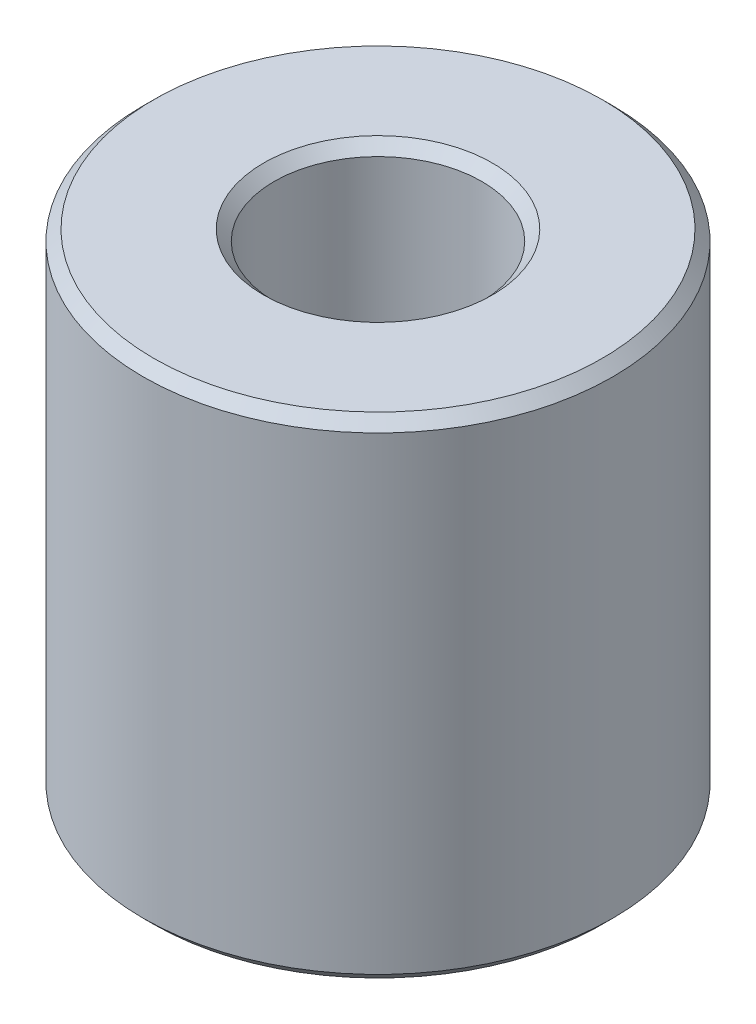
ISO-10303-21;
HEADER;
FILE_DESCRIPTION(('STEP AP214'),'2;1');
FILE_NAME('part.step','',(''),(''),'','','');
FILE_SCHEMA(('AUTOMOTIVE_DESIGN { 1 0 10303 214 1 1 1 1 }'));
ENDSEC;
DATA;
#1=APPLICATION_CONTEXT('core data for automotive mechanical design processes');
#2=APPLICATION_PROTOCOL_DEFINITION('international standard','automotive_design',2000,#1);
#3=PRODUCT_CONTEXT('',#1,'mechanical');
#4=PRODUCT('Part','Part','',(#3));
#5=PRODUCT_RELATED_PRODUCT_CATEGORY('part','',(#4));
#6=PRODUCT_DEFINITION_FORMATION('','',#4);
#7=PRODUCT_DEFINITION_CONTEXT('part definition',#1,'design');
#8=PRODUCT_DEFINITION('design','',#6,#7);
#9=PRODUCT_DEFINITION_SHAPE('','',#8);
#10=(LENGTH_UNIT() NAMED_UNIT(*) SI_UNIT(.MILLI.,.METRE.));
#11=(NAMED_UNIT(*) PLANE_ANGLE_UNIT() SI_UNIT($,.RADIAN.));
#12=(NAMED_UNIT(*) SI_UNIT($,.STERADIAN.) SOLID_ANGLE_UNIT());
#13=UNCERTAINTY_MEASURE_WITH_UNIT(LENGTH_MEASURE(1.E-05),#10,'distance_accuracy_value','');
#14=(GEOMETRIC_REPRESENTATION_CONTEXT(3) GLOBAL_UNCERTAINTY_ASSIGNED_CONTEXT((#13)) GLOBAL_UNIT_ASSIGNED_CONTEXT((#10,
#11,#12)) REPRESENTATION_CONTEXT('',''));
#15=CARTESIAN_POINT('',(0.,0.,0.));
#16=DIRECTION('',(0.,0.,1.));
#17=DIRECTION('',(1.,0.,0.));
#18=AXIS2_PLACEMENT_3D('',#15,#16,#17);
#19=CARTESIAN_POINT('',(0.,83.4997781604781,0.));
#20=DIRECTION('',(0.,-1.,0.));
#21=DIRECTION('',(0.,0.,-1.));
#22=AXIS2_PLACEMENT_3D('',#19,#20,#21);
#23=CYLINDRICAL_SURFACE('',#22,40.);
#24=CARTESIAN_POINT('',(0.,1.81067606176168,0.));
#25=DIRECTION('',(0.,1.,0.));
#26=DIRECTION('',(0.,0.,1.));
#27=AXIS2_PLACEMENT_3D('',#24,#25,#26);
#28=CIRCLE('',#27,40.);
#29=CARTESIAN_POINT('',(0.,1.81067606176168,40.));
#30=VERTEX_POINT('',#29);
#31=EDGE_CURVE('E10',#30,#30,#28,.T.);
#32=ORIENTED_EDGE('',*,*,#31,.T.);
#33=EDGE_LOOP('',(#32));
#34=FACE_BOUND('',#33,.T.);
#35=CARTESIAN_POINT('',(0.,81.6891020987164,0.));
#36=DIRECTION('',(0.,1.,0.));
#37=DIRECTION('',(0.,0.,1.));
#38=AXIS2_PLACEMENT_3D('',#35,#36,#37);
#39=CIRCLE('',#38,40.);
#40=CARTESIAN_POINT('',(0.,81.6891020987164,40.));
#41=VERTEX_POINT('',#40);
#42=EDGE_CURVE('E50',#41,#41,#39,.F.);
#43=ORIENTED_EDGE('',*,*,#42,.T.);
#44=EDGE_LOOP('',(#43));
#45=FACE_BOUND('',#44,.T.);
#46=ADVANCED_FACE('F39',(#34,#45),#23,.T.);
#47=CARTESIAN_POINT('',(0.,83.4997781604781,0.));
#48=DIRECTION('',(0.,1.,0.));
#49=DIRECTION('',(0.,0.,1.));
#50=AXIS2_PLACEMENT_3D('',#47,#48,#49);
#51=PLANE('',#50);
#52=CARTESIAN_POINT('',(0.,83.4997781604781,0.));
#53=DIRECTION('',(0.,1.,0.));
#54=DIRECTION('',(0.,0.,1.));
#55=AXIS2_PLACEMENT_3D('',#52,#53,#54);
#56=CIRCLE('',#55,19.4904680246034);
#57=CARTESIAN_POINT('',(0.,83.4997781604781,19.4904680246034));
#58=VERTEX_POINT('',#57);
#59=EDGE_CURVE('E58',#58,#58,#56,.F.);
#60=ORIENTED_EDGE('',*,*,#59,.T.);
#61=EDGE_LOOP('',(#60));
#62=FACE_BOUND('',#61,.T.);
#63=CARTESIAN_POINT('',(0.,83.4997781604781,0.));
#64=DIRECTION('',(0.,1.,0.));
#65=DIRECTION('',(0.,0.,1.));
#66=AXIS2_PLACEMENT_3D('',#63,#64,#65);
#67=CIRCLE('',#66,38.1893239382383);
#68=CARTESIAN_POINT('',(0.,83.4997781604781,38.1893239382383));
#69=VERTEX_POINT('',#68);
#70=EDGE_CURVE('E61',#69,#69,#67,.T.);
#71=ORIENTED_EDGE('',*,*,#70,.T.);
#72=EDGE_LOOP('',(#71));
#73=FACE_BOUND('',#72,.T.);
#74=ADVANCED_FACE('F88',(#62,#73),#51,.T.);
#75=CARTESIAN_POINT('',(0.,0.,0.));
#76=DIRECTION('',(0.,1.,0.));
#77=DIRECTION('',(0.,0.,1.));
#78=AXIS2_PLACEMENT_3D('',#75,#76,#77);
#79=PLANE('',#78);
#80=CARTESIAN_POINT('',(0.,0.,0.));
#81=DIRECTION('',(0.,1.,0.));
#82=DIRECTION('',(0.,0.,1.));
#83=AXIS2_PLACEMENT_3D('',#80,#81,#82);
#84=CIRCLE('',#83,19.4904680246034);
#85=CARTESIAN_POINT('',(0.,0.,19.4904680246034));
#86=VERTEX_POINT('',#85);
#87=EDGE_CURVE('E51',#86,#86,#84,.T.);
#88=ORIENTED_EDGE('',*,*,#87,.T.);
#89=EDGE_LOOP('',(#88));
#90=FACE_BOUND('',#89,.T.);
#91=CARTESIAN_POINT('',(0.,0.,0.));
#92=DIRECTION('',(0.,1.,0.));
#93=DIRECTION('',(0.,0.,1.));
#94=AXIS2_PLACEMENT_3D('',#91,#92,#93);
#95=CIRCLE('',#94,38.1893239382383);
#96=CARTESIAN_POINT('',(0.,0.,38.1893239382383));
#97=VERTEX_POINT('',#96);
#98=EDGE_CURVE('E54',#97,#97,#95,.F.);
#99=ORIENTED_EDGE('',*,*,#98,.T.);
#100=EDGE_LOOP('',(#99));
#101=FACE_BOUND('',#100,.T.);
#102=ADVANCED_FACE('F83',(#90,#101),#79,.F.);
#103=CARTESIAN_POINT('',(0.,83.4997781604781,0.));
#104=DIRECTION('',(0.,-1.,0.));
#105=DIRECTION('',(0.,0.,-1.));
#106=AXIS2_PLACEMENT_3D('',#103,#104,#105);
#107=CYLINDRICAL_SURFACE('',#106,17.6797919628417);
#108=CARTESIAN_POINT('',(0.,81.6891020987164,0.));
#109=DIRECTION('',(0.,1.,0.));
#110=DIRECTION('',(0.,0.,1.));
#111=AXIS2_PLACEMENT_3D('',#108,#109,#110);
#112=CIRCLE('',#111,17.6797919628417);
#113=CARTESIAN_POINT('',(0.,81.6891020987164,17.6797919628417));
#114=VERTEX_POINT('',#113);
#115=EDGE_CURVE('E67',#114,#114,#112,.T.);
#116=ORIENTED_EDGE('',*,*,#115,.T.);
#117=EDGE_LOOP('',(#116));
#118=FACE_BOUND('',#117,.T.);
#119=CARTESIAN_POINT('',(0.,1.8106760617617,0.));
#120=DIRECTION('',(0.,1.,0.));
#121=DIRECTION('',(0.,0.,1.));
#122=AXIS2_PLACEMENT_3D('',#119,#120,#121);
#123=CIRCLE('',#122,17.6797919628417);
#124=CARTESIAN_POINT('',(0.,1.8106760617617,17.6797919628417));
#125=VERTEX_POINT('',#124);
#126=EDGE_CURVE('E69',#125,#125,#123,.F.);
#127=ORIENTED_EDGE('',*,*,#126,.T.);
#128=EDGE_LOOP('',(#127));
#129=FACE_BOUND('',#128,.T.);
#130=ADVANCED_FACE('F71',(#118,#129),#107,.F.);
#131=CARTESIAN_POINT('',(0.,81.6891020987164,0.));
#132=DIRECTION('',(0.,1.,0.));
#133=DIRECTION('',(0.,0.,1.));
#134=AXIS2_PLACEMENT_3D('',#131,#132,#133);
#135=CONICAL_SURFACE('',#134,17.6797919628417,0.785398163397447);
#136=ORIENTED_EDGE('',*,*,#59,.F.);
#137=EDGE_LOOP('',(#136));
#138=FACE_BOUND('',#137,.T.);
#139=ORIENTED_EDGE('',*,*,#115,.F.);
#140=EDGE_LOOP('',(#139));
#141=FACE_BOUND('',#140,.T.);
#142=ADVANCED_FACE('F77',(#138,#141),#135,.F.);
#143=CARTESIAN_POINT('',(0.,0.,0.));
#144=DIRECTION('',(0.,-1.,0.));
#145=DIRECTION('',(0.,0.,-1.));
#146=AXIS2_PLACEMENT_3D('',#143,#144,#145);
#147=CONICAL_SURFACE('',#146,19.4904680246034,0.785398163397444);
#148=ORIENTED_EDGE('',*,*,#126,.F.);
#149=EDGE_LOOP('',(#148));
#150=FACE_BOUND('',#149,.T.);
#151=ORIENTED_EDGE('',*,*,#87,.F.);
#152=EDGE_LOOP('',(#151));
#153=FACE_BOUND('',#152,.T.);
#154=ADVANCED_FACE('F73',(#150,#153),#147,.F.);
#155=CARTESIAN_POINT('',(0.,1.81067606176168,0.));
#156=DIRECTION('',(0.,1.,0.));
#157=DIRECTION('',(0.,0.,1.));
#158=AXIS2_PLACEMENT_3D('',#155,#156,#157);
#159=CONICAL_SURFACE('',#158,40.,0.785398163397454);
#160=ORIENTED_EDGE('',*,*,#98,.F.);
#161=EDGE_LOOP('',(#160));
#162=FACE_BOUND('',#161,.T.);
#163=ORIENTED_EDGE('',*,*,#31,.F.);
#164=EDGE_LOOP('',(#163));
#165=FACE_BOUND('',#164,.T.);
#166=ADVANCED_FACE('F76',(#162,#165),#159,.T.);
#167=CARTESIAN_POINT('',(0.,83.4997781604781,0.));
#168=DIRECTION('',(0.,-1.,0.));
#169=DIRECTION('',(0.,0.,-1.));
#170=AXIS2_PLACEMENT_3D('',#167,#168,#169);
#171=CONICAL_SURFACE('',#170,38.1893239382383,0.785398163397439);
#172=ORIENTED_EDGE('',*,*,#42,.F.);
#173=EDGE_LOOP('',(#172));
#174=FACE_BOUND('',#173,.T.);
#175=ORIENTED_EDGE('',*,*,#70,.F.);
#176=EDGE_LOOP('',(#175));
#177=FACE_BOUND('',#176,.T.);
#178=ADVANCED_FACE('F45',(#174,#177),#171,.T.);
#179=CLOSED_SHELL('',(#46,#74,#102,#130,#142,#154,#166,#178));
#180=MANIFOLD_SOLID_BREP('B2',#179);
#181=ADVANCED_BREP_SHAPE_REPRESENTATION('',(#18,#180),#14);
#182=SHAPE_DEFINITION_REPRESENTATION(#9,#181);
ENDSEC;
END-ISO-10303-21;
